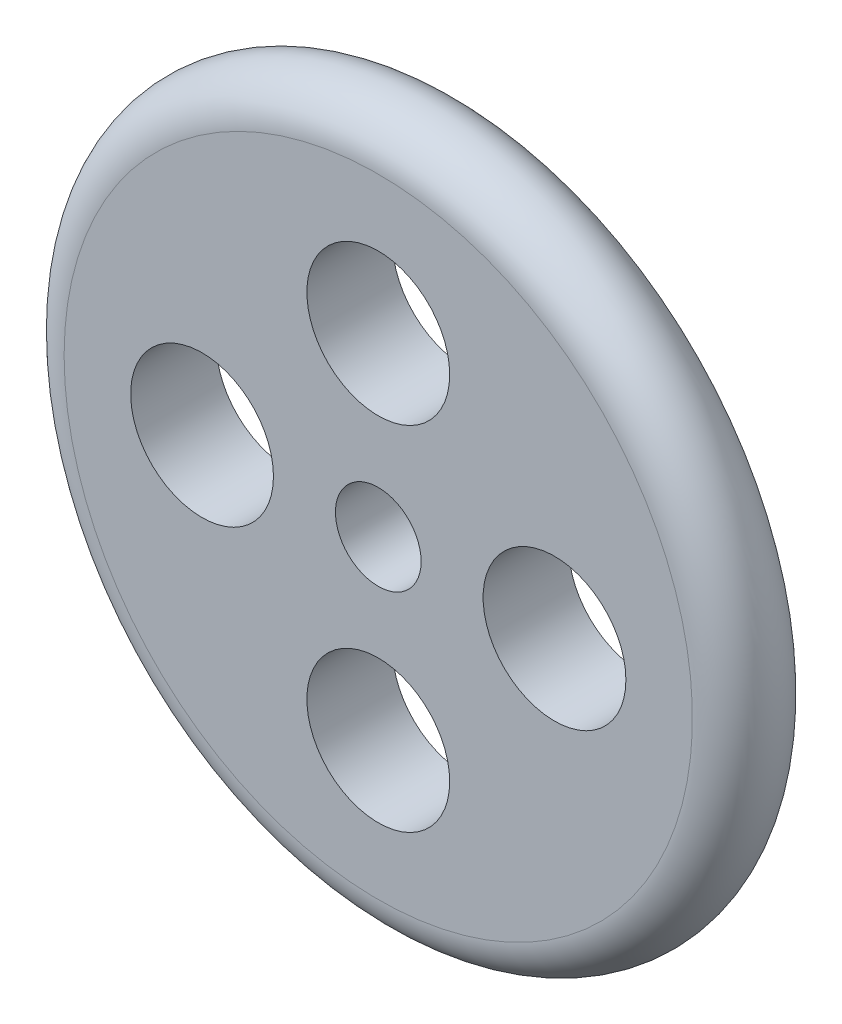
ISO-10303-21;
HEADER;
FILE_DESCRIPTION(('STEP AP214'),'2;1');
FILE_NAME('part.step','',(''),(''),'','','');
FILE_SCHEMA(('AUTOMOTIVE_DESIGN { 1 0 10303 214 1 1 1 1 }'));
ENDSEC;
DATA;
#1=APPLICATION_CONTEXT('core data for automotive mechanical design processes');
#2=APPLICATION_PROTOCOL_DEFINITION('international standard','automotive_design',2000,#1);
#3=PRODUCT_CONTEXT('',#1,'mechanical');
#4=PRODUCT('Part','Part','',(#3));
#5=PRODUCT_RELATED_PRODUCT_CATEGORY('part','',(#4));
#6=PRODUCT_DEFINITION_FORMATION('','',#4);
#7=PRODUCT_DEFINITION_CONTEXT('part definition',#1,'design');
#8=PRODUCT_DEFINITION('design','',#6,#7);
#9=PRODUCT_DEFINITION_SHAPE('','',#8);
#10=(LENGTH_UNIT() NAMED_UNIT(*) SI_UNIT(.MILLI.,.METRE.));
#11=(NAMED_UNIT(*) PLANE_ANGLE_UNIT() SI_UNIT($,.RADIAN.));
#12=(NAMED_UNIT(*) SI_UNIT($,.STERADIAN.) SOLID_ANGLE_UNIT());
#13=UNCERTAINTY_MEASURE_WITH_UNIT(LENGTH_MEASURE(1.E-05),#10,'distance_accuracy_value','');
#14=(GEOMETRIC_REPRESENTATION_CONTEXT(3) GLOBAL_UNCERTAINTY_ASSIGNED_CONTEXT((#13)) GLOBAL_UNIT_ASSIGNED_CONTEXT((#10,
#11,#12)) REPRESENTATION_CONTEXT('',''));
#15=CARTESIAN_POINT('',(0.,0.,0.));
#16=DIRECTION('',(0.,0.,1.));
#17=DIRECTION('',(1.,0.,0.));
#18=AXIS2_PLACEMENT_3D('',#15,#16,#17);
#19=CARTESIAN_POINT('',(-1.36917142715684E-06,0.,-45.7868740958901));
#20=DIRECTION('',(0.,0.,-1.));
#21=DIRECTION('',(-1.,0.,0.));
#22=AXIS2_PLACEMENT_3D('',#19,#20,#21);
#23=PLANE('',#22);
#24=CARTESIAN_POINT('',(0.,61.701118811981,-45.7868740958901));
#25=DIRECTION('',(0.,0.,1.));
#26=DIRECTION('',(1.,0.,0.));
#27=AXIS2_PLACEMENT_3D('',#24,#25,#26);
#28=CIRCLE('',#27,25.);
#29=CARTESIAN_POINT('',(25.,61.701118811981,-45.7868740958901));
#30=VERTEX_POINT('',#29);
#31=EDGE_CURVE('E85',#30,#30,#28,.T.);
#32=ORIENTED_EDGE('',*,*,#31,.F.);
#33=EDGE_LOOP('',(#32));
#34=FACE_BOUND('',#33,.T.);
#35=CARTESIAN_POINT('',(61.7011188119828,1.74231695872587E-12,-45.7868740958901));
#36=DIRECTION('',(0.,0.,1.));
#37=DIRECTION('',(1.,0.,0.));
#38=AXIS2_PLACEMENT_3D('',#35,#36,#37);
#39=CIRCLE('',#38,25.);
#40=CARTESIAN_POINT('',(86.7011188119828,1.74231695872587E-12,-45.7868740958901));
#41=VERTEX_POINT('',#40);
#42=EDGE_CURVE('E77',#41,#41,#39,.T.);
#43=ORIENTED_EDGE('',*,*,#42,.F.);
#44=EDGE_LOOP('',(#43));
#45=FACE_BOUND('',#44,.T.);
#46=CARTESIAN_POINT('',(3.48463391745174E-12,-61.701118811981,-45.7868740958901));
#47=DIRECTION('',(0.,0.,1.));
#48=DIRECTION('',(1.,0.,0.));
#49=AXIS2_PLACEMENT_3D('',#46,#47,#48);
#50=CIRCLE('',#49,25.);
#51=CARTESIAN_POINT('',(25.0000000000035,-61.701118811981,-45.7868740958901));
#52=VERTEX_POINT('',#51);
#53=EDGE_CURVE('E69',#52,#52,#50,.T.);
#54=ORIENTED_EDGE('',*,*,#53,.F.);
#55=EDGE_LOOP('',(#54));
#56=FACE_BOUND('',#55,.T.);
#57=CARTESIAN_POINT('',(-61.7011188119793,-1.74987316649156E-12,-45.7868740958901));
#58=DIRECTION('',(0.,0.,1.));
#59=DIRECTION('',(1.,0.,0.));
#60=AXIS2_PLACEMENT_3D('',#57,#58,#59);
#61=CIRCLE('',#60,25.);
#62=CARTESIAN_POINT('',(-36.7011188119793,-1.74987316649156E-12,-45.7868740958901));
#63=VERTEX_POINT('',#62);
#64=EDGE_CURVE('E61',#63,#63,#61,.T.);
#65=ORIENTED_EDGE('',*,*,#64,.F.);
#66=EDGE_LOOP('',(#65));
#67=FACE_BOUND('',#66,.T.);
#68=CARTESIAN_POINT('',(0.,0.,-45.7868740958901));
#69=DIRECTION('',(0.,0.,1.));
#70=DIRECTION('',(1.,0.,0.));
#71=AXIS2_PLACEMENT_3D('',#68,#69,#70);
#72=CIRCLE('',#71,15.);
#73=CARTESIAN_POINT('',(15.,0.,-45.7868740958901));
#74=VERTEX_POINT('',#73);
#75=EDGE_CURVE('E54',#74,#74,#72,.T.);
#76=ORIENTED_EDGE('',*,*,#75,.F.);
#77=EDGE_LOOP('',(#76));
#78=FACE_BOUND('',#77,.T.);
#79=CARTESIAN_POINT('',(-1.36917142715684E-06,0.,-45.7868740958901));
#80=DIRECTION('',(0.,0.,-1.));
#81=DIRECTION('',(-1.,0.,0.));
#82=AXIS2_PLACEMENT_3D('',#79,#80,#81);
#83=CIRCLE('',#82,110.);
#84=CARTESIAN_POINT('',(-110.000001369171,0.,-45.7868740958901));
#85=VERTEX_POINT('',#84);
#86=EDGE_CURVE('E10',#85,#85,#83,.T.);
#87=ORIENTED_EDGE('',*,*,#86,.F.);
#88=EDGE_LOOP('',(#87));
#89=FACE_BOUND('',#88,.T.);
#90=ADVANCED_FACE('F37',(#34,#45,#56,#67,#78,#89),#23,.F.);
#91=CARTESIAN_POINT('',(-1.36917142901094E-06,0.,-60.7868740958901));
#92=DIRECTION('',(0.,0.,-1.));
#93=DIRECTION('',(-1.,0.,0.));
#94=AXIS2_PLACEMENT_3D('',#91,#92,#93);
#95=TOROIDAL_SURFACE('',#94,110.,15.);
#96=CARTESIAN_POINT('',(-1.36917143083078E-06,0.,-75.7868740958901));
#97=DIRECTION('',(0.,0.,-1.));
#98=DIRECTION('',(-1.,0.,0.));
#99=AXIS2_PLACEMENT_3D('',#96,#97,#98);
#100=CIRCLE('',#99,110.);
#101=CARTESIAN_POINT('',(-110.000001369171,0.,-75.7868740958901));
#102=VERTEX_POINT('',#101);
#103=EDGE_CURVE('E44',#102,#102,#100,.T.);
#104=ORIENTED_EDGE('',*,*,#103,.F.);
#105=EDGE_LOOP('',(#104));
#106=FACE_BOUND('',#105,.T.);
#107=ORIENTED_EDGE('',*,*,#86,.T.);
#108=EDGE_LOOP('',(#107));
#109=FACE_BOUND('',#108,.T.);
#110=ADVANCED_FACE('F105',(#106,#109),#95,.T.);
#111=CARTESIAN_POINT('',(-1.36917143083078E-06,0.,-75.7868740958901));
#112=DIRECTION('',(0.,0.,1.));
#113=DIRECTION('',(1.,0.,0.));
#114=AXIS2_PLACEMENT_3D('',#111,#112,#113);
#115=PLANE('',#114);
#116=CARTESIAN_POINT('',(0.,61.701118811981,-75.7868740958901));
#117=DIRECTION('',(0.,0.,1.));
#118=DIRECTION('',(1.,0.,0.));
#119=AXIS2_PLACEMENT_3D('',#116,#117,#118);
#120=CIRCLE('',#119,25.);
#121=CARTESIAN_POINT('',(25.,61.701118811981,-75.7868740958901));
#122=VERTEX_POINT('',#121);
#123=EDGE_CURVE('E59',#122,#122,#120,.T.);
#124=ORIENTED_EDGE('',*,*,#123,.T.);
#125=EDGE_LOOP('',(#124));
#126=FACE_BOUND('',#125,.T.);
#127=CARTESIAN_POINT('',(61.7011188119828,1.74231695872587E-12,-75.7868740958901));
#128=DIRECTION('',(0.,0.,1.));
#129=DIRECTION('',(1.,0.,0.));
#130=AXIS2_PLACEMENT_3D('',#127,#128,#129);
#131=CIRCLE('',#130,25.);
#132=CARTESIAN_POINT('',(86.7011188119828,1.74231695872587E-12,-75.7868740958901));
#133=VERTEX_POINT('',#132);
#134=EDGE_CURVE('E81',#133,#133,#131,.T.);
#135=ORIENTED_EDGE('',*,*,#134,.T.);
#136=EDGE_LOOP('',(#135));
#137=FACE_BOUND('',#136,.T.);
#138=CARTESIAN_POINT('',(3.48463391745174E-12,-61.701118811981,-75.7868740958901));
#139=DIRECTION('',(0.,0.,1.));
#140=DIRECTION('',(1.,0.,0.));
#141=AXIS2_PLACEMENT_3D('',#138,#139,#140);
#142=CIRCLE('',#141,25.);
#143=CARTESIAN_POINT('',(25.0000000000035,-61.701118811981,-75.7868740958901));
#144=VERTEX_POINT('',#143);
#145=EDGE_CURVE('E73',#144,#144,#142,.T.);
#146=ORIENTED_EDGE('',*,*,#145,.T.);
#147=EDGE_LOOP('',(#146));
#148=FACE_BOUND('',#147,.T.);
#149=CARTESIAN_POINT('',(-61.7011188119793,-1.74987316649156E-12,-75.7868740958901));
#150=DIRECTION('',(0.,0.,1.));
#151=DIRECTION('',(1.,0.,0.));
#152=AXIS2_PLACEMENT_3D('',#149,#150,#151);
#153=CIRCLE('',#152,25.);
#154=CARTESIAN_POINT('',(-36.7011188119793,-1.74987316649156E-12,-75.7868740958901));
#155=VERTEX_POINT('',#154);
#156=EDGE_CURVE('E65',#155,#155,#153,.T.);
#157=ORIENTED_EDGE('',*,*,#156,.T.);
#158=EDGE_LOOP('',(#157));
#159=FACE_BOUND('',#158,.T.);
#160=CARTESIAN_POINT('',(0.,0.,-75.7868740958901));
#161=DIRECTION('',(0.,0.,1.));
#162=DIRECTION('',(1.,0.,0.));
#163=AXIS2_PLACEMENT_3D('',#160,#161,#162);
#164=CIRCLE('',#163,15.);
#165=CARTESIAN_POINT('',(15.,0.,-75.7868740958901));
#166=VERTEX_POINT('',#165);
#167=EDGE_CURVE('E49',#166,#166,#164,.T.);
#168=ORIENTED_EDGE('',*,*,#167,.T.);
#169=EDGE_LOOP('',(#168));
#170=FACE_BOUND('',#169,.T.);
#171=ORIENTED_EDGE('',*,*,#103,.T.);
#172=EDGE_LOOP('',(#171));
#173=FACE_BOUND('',#172,.T.);
#174=ADVANCED_FACE('F93',(#126,#137,#148,#159,#170,#173),#115,.F.);
#175=CARTESIAN_POINT('',(0.,0.,-75.7868740958901));
#176=DIRECTION('',(0.,0.,1.));
#177=DIRECTION('',(1.,0.,0.));
#178=AXIS2_PLACEMENT_3D('',#175,#176,#177);
#179=CYLINDRICAL_SURFACE('',#178,15.);
#180=ORIENTED_EDGE('',*,*,#167,.F.);
#181=EDGE_LOOP('',(#180));
#182=FACE_BOUND('',#181,.T.);
#183=ORIENTED_EDGE('',*,*,#75,.T.);
#184=EDGE_LOOP('',(#183));
#185=FACE_BOUND('',#184,.T.);
#186=ADVANCED_FACE('F115',(#182,#185),#179,.F.);
#187=CARTESIAN_POINT('',(-61.7011188119793,-1.74987316649156E-12,-75.7868740958901));
#188=DIRECTION('',(0.,0.,1.));
#189=DIRECTION('',(1.,0.,0.));
#190=AXIS2_PLACEMENT_3D('',#187,#188,#189);
#191=CYLINDRICAL_SURFACE('',#190,25.);
#192=ORIENTED_EDGE('',*,*,#156,.F.);
#193=EDGE_LOOP('',(#192));
#194=FACE_BOUND('',#193,.T.);
#195=ORIENTED_EDGE('',*,*,#64,.T.);
#196=EDGE_LOOP('',(#195));
#197=FACE_BOUND('',#196,.T.);
#198=ADVANCED_FACE('F117',(#194,#197),#191,.F.);
#199=CARTESIAN_POINT('',(3.48463391745174E-12,-61.701118811981,-75.7868740958901));
#200=DIRECTION('',(0.,0.,1.));
#201=DIRECTION('',(1.,0.,0.));
#202=AXIS2_PLACEMENT_3D('',#199,#200,#201);
#203=CYLINDRICAL_SURFACE('',#202,25.);
#204=ORIENTED_EDGE('',*,*,#145,.F.);
#205=EDGE_LOOP('',(#204));
#206=FACE_BOUND('',#205,.T.);
#207=ORIENTED_EDGE('',*,*,#53,.T.);
#208=EDGE_LOOP('',(#207));
#209=FACE_BOUND('',#208,.T.);
#210=ADVANCED_FACE('F124',(#206,#209),#203,.F.);
#211=CARTESIAN_POINT('',(61.7011188119828,1.74231695872587E-12,-75.7868740958901));
#212=DIRECTION('',(0.,0.,1.));
#213=DIRECTION('',(1.,0.,0.));
#214=AXIS2_PLACEMENT_3D('',#211,#212,#213);
#215=CYLINDRICAL_SURFACE('',#214,25.);
#216=ORIENTED_EDGE('',*,*,#134,.F.);
#217=EDGE_LOOP('',(#216));
#218=FACE_BOUND('',#217,.T.);
#219=ORIENTED_EDGE('',*,*,#42,.T.);
#220=EDGE_LOOP('',(#219));
#221=FACE_BOUND('',#220,.T.);
#222=ADVANCED_FACE('F99',(#218,#221),#215,.F.);
#223=CARTESIAN_POINT('',(0.,61.701118811981,-75.7868740958901));
#224=DIRECTION('',(0.,0.,1.));
#225=DIRECTION('',(1.,0.,0.));
#226=AXIS2_PLACEMENT_3D('',#223,#224,#225);
#227=CYLINDRICAL_SURFACE('',#226,25.);
#228=ORIENTED_EDGE('',*,*,#123,.F.);
#229=EDGE_LOOP('',(#228));
#230=FACE_BOUND('',#229,.T.);
#231=ORIENTED_EDGE('',*,*,#31,.T.);
#232=EDGE_LOOP('',(#231));
#233=FACE_BOUND('',#232,.T.);
#234=ADVANCED_FACE('F96',(#230,#233),#227,.F.);
#235=CLOSED_SHELL('',(#90,#110,#174,#186,#198,#210,#222,#234));
#236=MANIFOLD_SOLID_BREP('B2',#235);
#237=ADVANCED_BREP_SHAPE_REPRESENTATION('',(#18,#236),#14);
#238=SHAPE_DEFINITION_REPRESENTATION(#9,#237);
ENDSEC;
END-ISO-10303-21;
